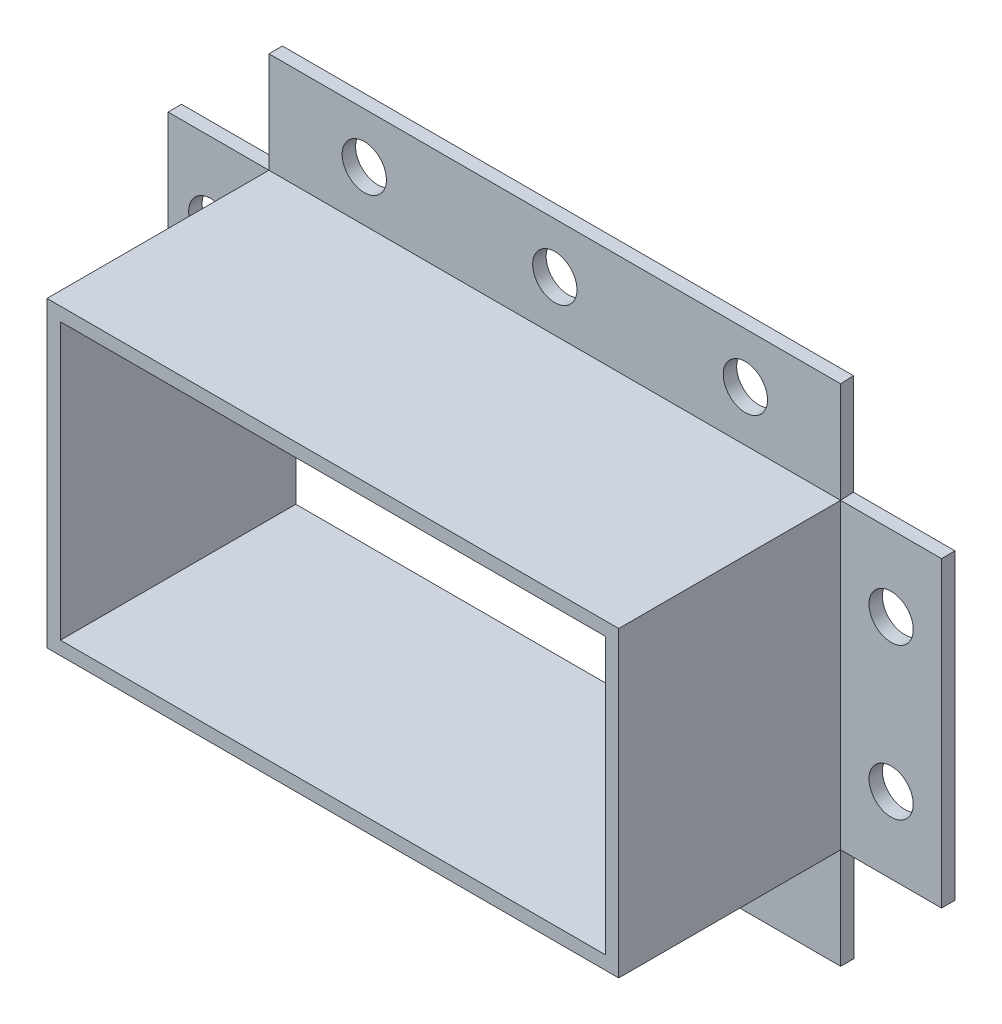
ISO-10303-21;
HEADER;
FILE_DESCRIPTION(('STEP AP214'),'2;1');
FILE_NAME('part.step','',(''),(''),'','','');
FILE_SCHEMA(('AUTOMOTIVE_DESIGN { 1 0 10303 214 1 1 1 1 }'));
ENDSEC;
DATA;
#1=APPLICATION_CONTEXT('core data for automotive mechanical design processes');
#2=APPLICATION_PROTOCOL_DEFINITION('international standard','automotive_design',2000,#1);
#3=PRODUCT_CONTEXT('',#1,'mechanical');
#4=PRODUCT('Part','Part','',(#3));
#5=PRODUCT_RELATED_PRODUCT_CATEGORY('part','',(#4));
#6=PRODUCT_DEFINITION_FORMATION('','',#4);
#7=PRODUCT_DEFINITION_CONTEXT('part definition',#1,'design');
#8=PRODUCT_DEFINITION('design','',#6,#7);
#9=PRODUCT_DEFINITION_SHAPE('','',#8);
#10=(LENGTH_UNIT() NAMED_UNIT(*) SI_UNIT(.MILLI.,.METRE.));
#11=(NAMED_UNIT(*) PLANE_ANGLE_UNIT() SI_UNIT($,.RADIAN.));
#12=(NAMED_UNIT(*) SI_UNIT($,.STERADIAN.) SOLID_ANGLE_UNIT());
#13=UNCERTAINTY_MEASURE_WITH_UNIT(LENGTH_MEASURE(1.E-05),#10,'distance_accuracy_value','');
#14=(GEOMETRIC_REPRESENTATION_CONTEXT(3) GLOBAL_UNCERTAINTY_ASSIGNED_CONTEXT((#13)) GLOBAL_UNIT_ASSIGNED_CONTEXT((#10,
#11,#12)) REPRESENTATION_CONTEXT('',''));
#15=CARTESIAN_POINT('',(0.,0.,0.));
#16=DIRECTION('',(0.,0.,1.));
#17=DIRECTION('',(1.,0.,0.));
#18=AXIS2_PLACEMENT_3D('',#15,#16,#17);
#19=CARTESIAN_POINT('',(-42.5,-22.5,35.));
#20=DIRECTION('',(0.,1.,0.));
#21=DIRECTION('',(0.,0.,1.));
#22=AXIS2_PLACEMENT_3D('',#19,#20,#21);
#23=PLANE('',#22);
#24=DIRECTION('',(0.,0.,1.));
#25=VECTOR('',#24,1.);
#26=CARTESIAN_POINT('',(42.5,-22.5,1.99999999999999));
#27=LINE('',#26,#25);
#28=CARTESIAN_POINT('',(42.5,-22.5,0.));
#29=VERTEX_POINT('',#28);
#30=CARTESIAN_POINT('',(42.5,-22.5,1.99999999999999));
#31=VERTEX_POINT('',#30);
#32=EDGE_CURVE('E64',#29,#31,#27,.T.);
#33=ORIENTED_EDGE('',*,*,#32,.F.);
#34=DIRECTION('',(1.,0.,0.));
#35=VECTOR('',#34,1.);
#36=CARTESIAN_POINT('',(-42.5,-22.5,0.));
#37=LINE('',#36,#35);
#38=CARTESIAN_POINT('',(57.5,-22.5,0.));
#39=VERTEX_POINT('',#38);
#40=EDGE_CURVE('E423',#29,#39,#37,.T.);
#41=ORIENTED_EDGE('',*,*,#40,.T.);
#42=DIRECTION('',(0.,0.,-1.));
#43=VECTOR('',#42,1.);
#44=CARTESIAN_POINT('',(57.5,-22.5,1.99999999999999));
#45=LINE('',#44,#43);
#46=CARTESIAN_POINT('',(57.5,-22.5,1.99999999999999));
#47=VERTEX_POINT('',#46);
#48=EDGE_CURVE('E369',#47,#39,#45,.T.);
#49=ORIENTED_EDGE('',*,*,#48,.F.);
#50=DIRECTION('',(-1.,0.,0.));
#51=VECTOR('',#50,1.);
#52=CARTESIAN_POINT('',(57.5,-22.5,1.99999999999999));
#53=LINE('',#52,#51);
#54=EDGE_CURVE('E373',#47,#31,#53,.T.);
#55=ORIENTED_EDGE('',*,*,#54,.T.);
#56=EDGE_LOOP('',(#33,#41,#49,#55));
#57=FACE_BOUND('',#56,.T.);
#58=ADVANCED_FACE('F38',(#57),#23,.F.);
#59=DIRECTION('',(-1.,0.,0.));
#60=VECTOR('',#59,1.);
#61=CARTESIAN_POINT('',(42.5,-22.5,1.99999999999999));
#62=LINE('',#61,#60);
#63=CARTESIAN_POINT('',(-42.5,-22.5,1.99999999999999));
#64=VERTEX_POINT('',#63);
#65=EDGE_CURVE('E266',#31,#64,#62,.T.);
#66=ORIENTED_EDGE('',*,*,#65,.F.);
#67=DIRECTION('',(0.,0.,-1.));
#68=VECTOR('',#67,1.);
#69=CARTESIAN_POINT('',(42.5,-22.5,35.));
#70=LINE('',#69,#68);
#71=CARTESIAN_POINT('',(42.5,-22.5,35.));
#72=VERTEX_POINT('',#71);
#73=EDGE_CURVE('E417',#72,#31,#70,.T.);
#74=ORIENTED_EDGE('',*,*,#73,.F.);
#75=DIRECTION('',(1.,0.,0.));
#76=VECTOR('',#75,1.);
#77=CARTESIAN_POINT('',(-42.5,-22.5,35.));
#78=LINE('',#77,#76);
#79=CARTESIAN_POINT('',(-42.5,-22.5,35.));
#80=VERTEX_POINT('',#79);
#81=EDGE_CURVE('E414',#80,#72,#78,.T.);
#82=ORIENTED_EDGE('',*,*,#81,.F.);
#83=DIRECTION('',(0.,0.,-1.));
#84=VECTOR('',#83,1.);
#85=CARTESIAN_POINT('',(-42.5,-22.5,35.));
#86=LINE('',#85,#84);
#87=EDGE_CURVE('E429',#80,#64,#86,.T.);
#88=ORIENTED_EDGE('',*,*,#87,.T.);
#89=EDGE_LOOP('',(#66,#74,#82,#88));
#90=FACE_BOUND('',#89,.T.);
#91=ADVANCED_FACE('F476',(#90),#23,.F.);
#92=DIRECTION('',(0.,0.,-1.));
#93=VECTOR('',#92,1.);
#94=CARTESIAN_POINT('',(-42.5,-22.5,1.99999999999999));
#95=LINE('',#94,#93);
#96=CARTESIAN_POINT('',(-42.5,-22.5,0.));
#97=VERTEX_POINT('',#96);
#98=EDGE_CURVE('E270',#64,#97,#95,.T.);
#99=ORIENTED_EDGE('',*,*,#98,.F.);
#100=DIRECTION('',(1.,0.,0.));
#101=VECTOR('',#100,1.);
#102=CARTESIAN_POINT('',(-57.5,-22.5,1.99999999999999));
#103=LINE('',#102,#101);
#104=CARTESIAN_POINT('',(-57.5,-22.5,1.99999999999999));
#105=VERTEX_POINT('',#104);
#106=EDGE_CURVE('E307',#105,#64,#103,.T.);
#107=ORIENTED_EDGE('',*,*,#106,.F.);
#108=DIRECTION('',(0.,0.,1.));
#109=VECTOR('',#108,1.);
#110=CARTESIAN_POINT('',(-57.5,-22.5,1.99999999999999));
#111=LINE('',#110,#109);
#112=CARTESIAN_POINT('',(-57.5,-22.5,0.));
#113=VERTEX_POINT('',#112);
#114=EDGE_CURVE('E304',#113,#105,#111,.T.);
#115=ORIENTED_EDGE('',*,*,#114,.F.);
#116=EDGE_CURVE('E408',#113,#97,#37,.T.);
#117=ORIENTED_EDGE('',*,*,#116,.T.);
#118=EDGE_LOOP('',(#99,#107,#115,#117));
#119=FACE_BOUND('',#118,.T.);
#120=ADVANCED_FACE('F478',(#119),#23,.F.);
#121=CARTESIAN_POINT('',(-42.5,22.5,35.));
#122=DIRECTION('',(1.,0.,0.));
#123=DIRECTION('',(0.,0.,-1.));
#124=AXIS2_PLACEMENT_3D('',#121,#122,#123);
#125=PLANE('',#124);
#126=DIRECTION('',(0.,1.,0.));
#127=VECTOR('',#126,1.);
#128=CARTESIAN_POINT('',(-42.5,22.5,1.99999999999999));
#129=LINE('',#128,#127);
#130=CARTESIAN_POINT('',(-42.5,22.5,1.99999999999999));
#131=VERTEX_POINT('',#130);
#132=EDGE_CURVE('E291',#64,#131,#129,.T.);
#133=ORIENTED_EDGE('',*,*,#132,.F.);
#134=ORIENTED_EDGE('',*,*,#87,.F.);
#135=DIRECTION('',(0.,-1.,0.));
#136=VECTOR('',#135,1.);
#137=CARTESIAN_POINT('',(-42.5,22.5,35.));
#138=LINE('',#137,#136);
#139=CARTESIAN_POINT('',(-42.5,22.5,35.));
#140=VERTEX_POINT('',#139);
#141=EDGE_CURVE('E411',#140,#80,#138,.T.);
#142=ORIENTED_EDGE('',*,*,#141,.F.);
#143=DIRECTION('',(0.,0.,-1.));
#144=VECTOR('',#143,1.);
#145=CARTESIAN_POINT('',(-42.5,22.5,35.));
#146=LINE('',#145,#144);
#147=EDGE_CURVE('E48',#140,#131,#146,.T.);
#148=ORIENTED_EDGE('',*,*,#147,.T.);
#149=EDGE_LOOP('',(#133,#134,#142,#148));
#150=FACE_BOUND('',#149,.T.);
#151=ADVANCED_FACE('F486',(#150),#125,.F.);
#152=DIRECTION('',(0.,0.,-1.));
#153=VECTOR('',#152,1.);
#154=CARTESIAN_POINT('',(-42.5,22.5,1.99999999999999));
#155=LINE('',#154,#153);
#156=CARTESIAN_POINT('',(-42.5,22.5,0.));
#157=VERTEX_POINT('',#156);
#158=EDGE_CURVE('E297',#131,#157,#155,.T.);
#159=ORIENTED_EDGE('',*,*,#158,.F.);
#160=DIRECTION('',(0.,-1.,0.));
#161=VECTOR('',#160,1.);
#162=CARTESIAN_POINT('',(-42.5,37.5,1.99999999999999));
#163=LINE('',#162,#161);
#164=CARTESIAN_POINT('',(-42.5,37.5,1.99999999999999));
#165=VERTEX_POINT('',#164);
#166=EDGE_CURVE('E354',#165,#131,#163,.T.);
#167=ORIENTED_EDGE('',*,*,#166,.F.);
#168=DIRECTION('',(0.,0.,1.));
#169=VECTOR('',#168,1.);
#170=CARTESIAN_POINT('',(-42.5,37.5,1.99999999999999));
#171=LINE('',#170,#169);
#172=CARTESIAN_POINT('',(-42.5,37.5,0.));
#173=VERTEX_POINT('',#172);
#174=EDGE_CURVE('E330',#173,#165,#171,.T.);
#175=ORIENTED_EDGE('',*,*,#174,.F.);
#176=DIRECTION('',(0.,-1.,0.));
#177=VECTOR('',#176,1.);
#178=CARTESIAN_POINT('',(-42.5,22.5,0.));
#179=LINE('',#178,#177);
#180=EDGE_CURVE('E420',#173,#157,#179,.T.);
#181=ORIENTED_EDGE('',*,*,#180,.T.);
#182=EDGE_LOOP('',(#159,#167,#175,#181));
#183=FACE_BOUND('',#182,.T.);
#184=ADVANCED_FACE('F491',(#183),#125,.F.);
#185=CARTESIAN_POINT('',(-42.5,22.5,35.));
#186=DIRECTION('',(0.,-1.,0.));
#187=DIRECTION('',(1.,0.,0.));
#188=AXIS2_PLACEMENT_3D('',#185,#186,#187);
#189=PLANE('',#188);
#190=DIRECTION('',(-0.0510792903372847,0.,-0.998694601016066));
#191=VECTOR('',#190,1.);
#192=CARTESIAN_POINT('',(42.3977078873055,22.5,0.));
#193=LINE('',#192,#191);
#194=CARTESIAN_POINT('',(42.5,22.5,1.99999999999999));
#195=VERTEX_POINT('',#194);
#196=CARTESIAN_POINT('',(42.3977078873055,22.5,0.));
#197=VERTEX_POINT('',#196);
#198=EDGE_CURVE('E331',#195,#197,#193,.T.);
#199=ORIENTED_EDGE('',*,*,#198,.F.);
#200=DIRECTION('',(-1.,0.,0.));
#201=VECTOR('',#200,1.);
#202=CARTESIAN_POINT('',(57.5,22.5,2.));
#203=LINE('',#202,#201);
#204=CARTESIAN_POINT('',(57.5,22.5,2.));
#205=VERTEX_POINT('',#204);
#206=EDGE_CURVE('E379',#205,#195,#203,.T.);
#207=ORIENTED_EDGE('',*,*,#206,.F.);
#208=DIRECTION('',(0.,0.,1.));
#209=VECTOR('',#208,1.);
#210=CARTESIAN_POINT('',(57.5,22.5,0.));
#211=LINE('',#210,#209);
#212=CARTESIAN_POINT('',(57.5,22.5,0.));
#213=VERTEX_POINT('',#212);
#214=EDGE_CURVE('E363',#213,#205,#211,.T.);
#215=ORIENTED_EDGE('',*,*,#214,.F.);
#216=DIRECTION('',(-1.,0.,0.));
#217=VECTOR('',#216,1.);
#218=CARTESIAN_POINT('',(-42.5,22.5,0.));
#219=LINE('',#218,#217);
#220=EDGE_CURVE('E396',#213,#197,#219,.T.);
#221=ORIENTED_EDGE('',*,*,#220,.T.);
#222=EDGE_LOOP('',(#199,#207,#215,#221));
#223=FACE_BOUND('',#222,.T.);
#224=ADVANCED_FACE('F536',(#223),#189,.F.);
#225=DIRECTION('',(1.,0.,0.));
#226=VECTOR('',#225,1.);
#227=CARTESIAN_POINT('',(42.5,22.5,1.99999999999999));
#228=LINE('',#227,#226);
#229=EDGE_CURVE('E325',#131,#195,#228,.T.);
#230=ORIENTED_EDGE('',*,*,#229,.F.);
#231=ORIENTED_EDGE('',*,*,#147,.F.);
#232=DIRECTION('',(-1.,0.,0.));
#233=VECTOR('',#232,1.);
#234=CARTESIAN_POINT('',(-42.5,22.5,35.));
#235=LINE('',#234,#233);
#236=CARTESIAN_POINT('',(42.5,22.5,35.));
#237=VERTEX_POINT('',#236);
#238=EDGE_CURVE('E407',#237,#140,#235,.T.);
#239=ORIENTED_EDGE('',*,*,#238,.F.);
#240=DIRECTION('',(0.,0.,-1.));
#241=VECTOR('',#240,1.);
#242=CARTESIAN_POINT('',(42.5,22.5,35.));
#243=LINE('',#242,#241);
#244=EDGE_CURVE('E11',#237,#195,#243,.T.);
#245=ORIENTED_EDGE('',*,*,#244,.T.);
#246=EDGE_LOOP('',(#230,#231,#239,#245));
#247=FACE_BOUND('',#246,.T.);
#248=ADVANCED_FACE('F648',(#247),#189,.F.);
#249=CARTESIAN_POINT('',(42.5,22.5,35.));
#250=DIRECTION('',(-1.,0.,0.));
#251=DIRECTION('',(0.,0.,1.));
#252=AXIS2_PLACEMENT_3D('',#249,#250,#251);
#253=PLANE('',#252);
#254=DIRECTION('',(0.,-1.,0.));
#255=VECTOR('',#254,1.);
#256=CARTESIAN_POINT('',(42.5,22.5,2.));
#257=LINE('',#256,#255);
#258=EDGE_CURVE('E358',#195,#31,#257,.T.);
#259=ORIENTED_EDGE('',*,*,#258,.F.);
#260=ORIENTED_EDGE('',*,*,#244,.F.);
#261=DIRECTION('',(0.,1.,0.));
#262=VECTOR('',#261,1.);
#263=CARTESIAN_POINT('',(42.5,22.5,35.));
#264=LINE('',#263,#262);
#265=EDGE_CURVE('E403',#72,#237,#264,.T.);
#266=ORIENTED_EDGE('',*,*,#265,.F.);
#267=ORIENTED_EDGE('',*,*,#73,.T.);
#268=EDGE_LOOP('',(#259,#260,#266,#267));
#269=FACE_BOUND('',#268,.T.);
#270=ADVANCED_FACE('F40',(#269),#253,.F.);
#271=CARTESIAN_POINT('',(0.,0.,35.));
#272=DIRECTION('',(0.,0.,1.));
#273=DIRECTION('',(1.,0.,0.));
#274=AXIS2_PLACEMENT_3D('',#271,#272,#273);
#275=PLANE('',#274);
#276=DIRECTION('',(0.,-1.,0.));
#277=VECTOR('',#276,1.);
#278=CARTESIAN_POINT('',(-40.5,20.5,35.));
#279=LINE('',#278,#277);
#280=CARTESIAN_POINT('',(-40.5,20.5,35.));
#281=VERTEX_POINT('',#280);
#282=CARTESIAN_POINT('',(-40.5,-20.5,35.));
#283=VERTEX_POINT('',#282);
#284=EDGE_CURVE('E185',#281,#283,#279,.T.);
#285=ORIENTED_EDGE('',*,*,#284,.F.);
#286=DIRECTION('',(-1.,0.,0.));
#287=VECTOR('',#286,1.);
#288=CARTESIAN_POINT('',(40.5,20.5,35.));
#289=LINE('',#288,#287);
#290=CARTESIAN_POINT('',(40.5,20.5,35.));
#291=VERTEX_POINT('',#290);
#292=EDGE_CURVE('E190',#291,#281,#289,.T.);
#293=ORIENTED_EDGE('',*,*,#292,.F.);
#294=DIRECTION('',(0.,1.,0.));
#295=VECTOR('',#294,1.);
#296=CARTESIAN_POINT('',(40.5,20.5,35.));
#297=LINE('',#296,#295);
#298=CARTESIAN_POINT('',(40.5,-20.5,35.));
#299=VERTEX_POINT('',#298);
#300=EDGE_CURVE('E171',#299,#291,#297,.T.);
#301=ORIENTED_EDGE('',*,*,#300,.F.);
#302=DIRECTION('',(1.,0.,0.));
#303=VECTOR('',#302,1.);
#304=CARTESIAN_POINT('',(40.5,-20.5,35.));
#305=LINE('',#304,#303);
#306=EDGE_CURVE('E180',#283,#299,#305,.T.);
#307=ORIENTED_EDGE('',*,*,#306,.F.);
#308=EDGE_LOOP('',(#285,#293,#301,#307));
#309=FACE_BOUND('',#308,.T.);
#310=ORIENTED_EDGE('',*,*,#265,.T.);
#311=ORIENTED_EDGE('',*,*,#238,.T.);
#312=ORIENTED_EDGE('',*,*,#141,.T.);
#313=ORIENTED_EDGE('',*,*,#81,.T.);
#314=EDGE_LOOP('',(#310,#311,#312,#313));
#315=FACE_BOUND('',#314,.T.);
#316=ADVANCED_FACE('F187',(#309,#315),#275,.T.);
#317=CARTESIAN_POINT('',(0.,0.,0.));
#318=DIRECTION('',(0.,0.,1.));
#319=DIRECTION('',(1.,0.,0.));
#320=AXIS2_PLACEMENT_3D('',#317,#318,#319);
#321=PLANE('',#320);
#322=CARTESIAN_POINT('',(50.,11.25,0.));
#323=DIRECTION('',(0.,0.,1.));
#324=DIRECTION('',(1.,0.,0.));
#325=AXIS2_PLACEMENT_3D('',#322,#323,#324);
#326=CIRCLE('',#325,3.28999849999999);
#327=CARTESIAN_POINT('',(53.2899985,11.25,0.));
#328=VERTEX_POINT('',#327);
#329=EDGE_CURVE('E42',#328,#328,#326,.T.);
#330=ORIENTED_EDGE('',*,*,#329,.T.);
#331=EDGE_LOOP('',(#330));
#332=FACE_BOUND('',#331,.T.);
#333=CARTESIAN_POINT('',(50.,-11.25,0.));
#334=DIRECTION('',(0.,0.,1.));
#335=DIRECTION('',(1.,0.,0.));
#336=AXIS2_PLACEMENT_3D('',#333,#334,#335);
#337=CIRCLE('',#336,3.28999849999999);
#338=CARTESIAN_POINT('',(53.2899985,-11.25,0.));
#339=VERTEX_POINT('',#338);
#340=EDGE_CURVE('E205',#339,#339,#337,.T.);
#341=ORIENTED_EDGE('',*,*,#340,.T.);
#342=EDGE_LOOP('',(#341));
#343=FACE_BOUND('',#342,.T.);
#344=CARTESIAN_POINT('',(-51.1524006128283,-11.25,0.));
#345=DIRECTION('',(0.,0.,1.));
#346=DIRECTION('',(1.,0.,0.));
#347=AXIS2_PLACEMENT_3D('',#344,#345,#346);
#348=CIRCLE('',#347,3.28999849999999);
#349=CARTESIAN_POINT('',(-47.8624021128283,-11.25,0.));
#350=VERTEX_POINT('',#349);
#351=EDGE_CURVE('E210',#350,#350,#348,.T.);
#352=ORIENTED_EDGE('',*,*,#351,.T.);
#353=EDGE_LOOP('',(#352));
#354=FACE_BOUND('',#353,.T.);
#355=CARTESIAN_POINT('',(-51.1524006128283,11.25,0.));
#356=DIRECTION('',(0.,0.,1.));
#357=DIRECTION('',(1.,0.,0.));
#358=AXIS2_PLACEMENT_3D('',#355,#356,#357);
#359=CIRCLE('',#358,3.28999849999999);
#360=CARTESIAN_POINT('',(-47.8624021128283,11.25,0.));
#361=VERTEX_POINT('',#360);
#362=EDGE_CURVE('E215',#361,#361,#359,.T.);
#363=ORIENTED_EDGE('',*,*,#362,.T.);
#364=EDGE_LOOP('',(#363));
#365=FACE_BOUND('',#364,.T.);
#366=CARTESIAN_POINT('',(-28.33,30.,0.));
#367=DIRECTION('',(0.,0.,1.));
#368=DIRECTION('',(1.,0.,0.));
#369=AXIS2_PLACEMENT_3D('',#366,#367,#368);
#370=CIRCLE('',#369,3.28999849999999);
#371=CARTESIAN_POINT('',(-25.0400015,30.,0.));
#372=VERTEX_POINT('',#371);
#373=EDGE_CURVE('E220',#372,#372,#370,.T.);
#374=ORIENTED_EDGE('',*,*,#373,.T.);
#375=EDGE_LOOP('',(#374));
#376=FACE_BOUND('',#375,.T.);
#377=CARTESIAN_POINT('',(0.,30.,0.));
#378=DIRECTION('',(0.,0.,1.));
#379=DIRECTION('',(1.,0.,0.));
#380=AXIS2_PLACEMENT_3D('',#377,#378,#379);
#381=CIRCLE('',#380,3.28999849999999);
#382=CARTESIAN_POINT('',(3.28999849999999,30.,0.));
#383=VERTEX_POINT('',#382);
#384=EDGE_CURVE('E228',#383,#383,#381,.T.);
#385=ORIENTED_EDGE('',*,*,#384,.T.);
#386=EDGE_LOOP('',(#385));
#387=FACE_BOUND('',#386,.T.);
#388=CARTESIAN_POINT('',(28.33,30.,0.));
#389=DIRECTION('',(0.,0.,1.));
#390=DIRECTION('',(1.,0.,0.));
#391=AXIS2_PLACEMENT_3D('',#388,#389,#390);
#392=CIRCLE('',#391,3.28999849999999);
#393=CARTESIAN_POINT('',(31.6199985,30.,0.));
#394=VERTEX_POINT('',#393);
#395=EDGE_CURVE('E233',#394,#394,#392,.T.);
#396=ORIENTED_EDGE('',*,*,#395,.T.);
#397=EDGE_LOOP('',(#396));
#398=FACE_BOUND('',#397,.T.);
#399=CARTESIAN_POINT('',(28.33,-30.,0.));
#400=DIRECTION('',(0.,0.,1.));
#401=DIRECTION('',(1.,0.,0.));
#402=AXIS2_PLACEMENT_3D('',#399,#400,#401);
#403=CIRCLE('',#402,3.28999849999999);
#404=CARTESIAN_POINT('',(31.6199985,-30.,0.));
#405=VERTEX_POINT('',#404);
#406=EDGE_CURVE('E238',#405,#405,#403,.T.);
#407=ORIENTED_EDGE('',*,*,#406,.T.);
#408=EDGE_LOOP('',(#407));
#409=FACE_BOUND('',#408,.T.);
#410=CARTESIAN_POINT('',(0.,-30.,0.));
#411=DIRECTION('',(0.,0.,1.));
#412=DIRECTION('',(1.,0.,0.));
#413=AXIS2_PLACEMENT_3D('',#410,#411,#412);
#414=CIRCLE('',#413,3.28999849999999);
#415=CARTESIAN_POINT('',(3.28999849999999,-30.,0.));
#416=VERTEX_POINT('',#415);
#417=EDGE_CURVE('E243',#416,#416,#414,.T.);
#418=ORIENTED_EDGE('',*,*,#417,.T.);
#419=EDGE_LOOP('',(#418));
#420=FACE_BOUND('',#419,.T.);
#421=CARTESIAN_POINT('',(-28.33,-30.,0.));
#422=DIRECTION('',(0.,0.,1.));
#423=DIRECTION('',(1.,0.,0.));
#424=AXIS2_PLACEMENT_3D('',#421,#422,#423);
#425=CIRCLE('',#424,3.28999849999999);
#426=CARTESIAN_POINT('',(-25.0400015,-30.,0.));
#427=VERTEX_POINT('',#426);
#428=EDGE_CURVE('E251',#427,#427,#425,.T.);
#429=ORIENTED_EDGE('',*,*,#428,.T.);
#430=EDGE_LOOP('',(#429));
#431=FACE_BOUND('',#430,.T.);
#432=DIRECTION('',(1.,0.,0.));
#433=VECTOR('',#432,1.);
#434=CARTESIAN_POINT('',(40.5,20.5,0.));
#435=LINE('',#434,#433);
#436=CARTESIAN_POINT('',(-40.5,20.5,0.));
#437=VERTEX_POINT('',#436);
#438=CARTESIAN_POINT('',(40.5,20.5,0.));
#439=VERTEX_POINT('',#438);
#440=EDGE_CURVE('E385',#437,#439,#435,.T.);
#441=ORIENTED_EDGE('',*,*,#440,.F.);
#442=DIRECTION('',(0.,1.,0.));
#443=VECTOR('',#442,1.);
#444=CARTESIAN_POINT('',(-40.5,20.5,0.));
#445=LINE('',#444,#443);
#446=CARTESIAN_POINT('',(-40.5,-20.5,0.));
#447=VERTEX_POINT('',#446);
#448=EDGE_CURVE('E382',#447,#437,#445,.T.);
#449=ORIENTED_EDGE('',*,*,#448,.F.);
#450=DIRECTION('',(-1.,0.,0.));
#451=VECTOR('',#450,1.);
#452=CARTESIAN_POINT('',(40.5,-20.5,0.));
#453=LINE('',#452,#451);
#454=CARTESIAN_POINT('',(40.5,-20.5,0.));
#455=VERTEX_POINT('',#454);
#456=EDGE_CURVE('E391',#455,#447,#453,.T.);
#457=ORIENTED_EDGE('',*,*,#456,.F.);
#458=DIRECTION('',(0.,-1.,0.));
#459=VECTOR('',#458,1.);
#460=CARTESIAN_POINT('',(40.5,20.5,0.));
#461=LINE('',#460,#459);
#462=EDGE_CURVE('E174',#439,#455,#461,.T.);
#463=ORIENTED_EDGE('',*,*,#462,.F.);
#464=EDGE_LOOP('',(#441,#449,#457,#463));
#465=FACE_BOUND('',#464,.T.);
#466=ORIENTED_EDGE('',*,*,#220,.F.);
#467=DIRECTION('',(0.,1.,0.));
#468=VECTOR('',#467,1.);
#469=CARTESIAN_POINT('',(57.5,-22.5,0.));
#470=LINE('',#469,#468);
#471=EDGE_CURVE('E359',#39,#213,#470,.T.);
#472=ORIENTED_EDGE('',*,*,#471,.F.);
#473=ORIENTED_EDGE('',*,*,#40,.F.);
#474=DIRECTION('',(0.,1.,0.));
#475=VECTOR('',#474,1.);
#476=CARTESIAN_POINT('',(42.5,-37.5,0.));
#477=LINE('',#476,#475);
#478=CARTESIAN_POINT('',(42.5,-37.5,0.));
#479=VERTEX_POINT('',#478);
#480=EDGE_CURVE('E279',#479,#29,#477,.T.);
#481=ORIENTED_EDGE('',*,*,#480,.F.);
#482=DIRECTION('',(1.,0.,0.));
#483=VECTOR('',#482,1.);
#484=CARTESIAN_POINT('',(-42.5,-37.5,0.));
#485=LINE('',#484,#483);
#486=CARTESIAN_POINT('',(-42.5,-37.5,0.));
#487=VERTEX_POINT('',#486);
#488=EDGE_CURVE('E259',#487,#479,#485,.T.);
#489=ORIENTED_EDGE('',*,*,#488,.F.);
#490=DIRECTION('',(0.,1.,0.));
#491=VECTOR('',#490,1.);
#492=CARTESIAN_POINT('',(-42.5,-37.5,0.));
#493=LINE('',#492,#491);
#494=EDGE_CURVE('E283',#487,#97,#493,.T.);
#495=ORIENTED_EDGE('',*,*,#494,.T.);
#496=ORIENTED_EDGE('',*,*,#116,.F.);
#497=DIRECTION('',(0.,-1.,0.));
#498=VECTOR('',#497,1.);
#499=CARTESIAN_POINT('',(-57.5,22.5,0.));
#500=LINE('',#499,#498);
#501=CARTESIAN_POINT('',(-57.5,22.5,0.));
#502=VERTEX_POINT('',#501);
#503=EDGE_CURVE('E300',#502,#113,#500,.T.);
#504=ORIENTED_EDGE('',*,*,#503,.F.);
#505=DIRECTION('',(1.,0.,0.));
#506=VECTOR('',#505,1.);
#507=CARTESIAN_POINT('',(-57.5,22.5,0.));
#508=LINE('',#507,#506);
#509=EDGE_CURVE('E317',#502,#157,#508,.T.);
#510=ORIENTED_EDGE('',*,*,#509,.T.);
#511=ORIENTED_EDGE('',*,*,#180,.F.);
#512=DIRECTION('',(-1.,0.,0.));
#513=VECTOR('',#512,1.);
#514=CARTESIAN_POINT('',(42.3977078873055,37.5,0.));
#515=LINE('',#514,#513);
#516=CARTESIAN_POINT('',(42.3977078873055,37.5,0.));
#517=VERTEX_POINT('',#516);
#518=EDGE_CURVE('E326',#517,#173,#515,.T.);
#519=ORIENTED_EDGE('',*,*,#518,.F.);
#520=DIRECTION('',(0.,-1.,0.));
#521=VECTOR('',#520,1.);
#522=CARTESIAN_POINT('',(42.3977078873055,37.5,0.));
#523=LINE('',#522,#521);
#524=EDGE_CURVE('E340',#517,#197,#523,.T.);
#525=ORIENTED_EDGE('',*,*,#524,.T.);
#526=EDGE_LOOP('',(#466,#472,#473,#481,#489,#495,#496,#504,#510,#511,#519,#525));
#527=FACE_BOUND('',#526,.T.);
#528=ADVANCED_FACE('F457',(#332,#343,#354,#365,#376,#387,#398,#409,#420,#431,#465,#527),#321,.F.);
#529=CARTESIAN_POINT('',(-40.5,20.5,33.));
#530=DIRECTION('',(-1.,0.,0.));
#531=DIRECTION('',(0.,0.,1.));
#532=AXIS2_PLACEMENT_3D('',#529,#530,#531);
#533=PLANE('',#532);
#534=ORIENTED_EDGE('',*,*,#448,.T.);
#535=DIRECTION('',(0.,0.,-1.));
#536=VECTOR('',#535,1.);
#537=CARTESIAN_POINT('',(-40.5,20.5,33.));
#538=LINE('',#537,#536);
#539=EDGE_CURVE('E394',#281,#437,#538,.T.);
#540=ORIENTED_EDGE('',*,*,#539,.F.);
#541=ORIENTED_EDGE('',*,*,#284,.T.);
#542=DIRECTION('',(0.,0.,-1.));
#543=VECTOR('',#542,1.);
#544=CARTESIAN_POINT('',(-40.5,-20.5,33.));
#545=LINE('',#544,#543);
#546=EDGE_CURVE('E56',#283,#447,#545,.T.);
#547=ORIENTED_EDGE('',*,*,#546,.T.);
#548=EDGE_LOOP('',(#534,#540,#541,#547));
#549=FACE_BOUND('',#548,.T.);
#550=ADVANCED_FACE('F588',(#549),#533,.F.);
#551=CARTESIAN_POINT('',(40.5,-20.5,33.));
#552=DIRECTION('',(0.,-1.,0.));
#553=DIRECTION('',(0.,0.,-1.));
#554=AXIS2_PLACEMENT_3D('',#551,#552,#553);
#555=PLANE('',#554);
#556=ORIENTED_EDGE('',*,*,#456,.T.);
#557=ORIENTED_EDGE('',*,*,#546,.F.);
#558=ORIENTED_EDGE('',*,*,#306,.T.);
#559=DIRECTION('',(0.,0.,-1.));
#560=VECTOR('',#559,1.);
#561=CARTESIAN_POINT('',(40.5,-20.5,33.));
#562=LINE('',#561,#560);
#563=EDGE_CURVE('E168',#299,#455,#562,.T.);
#564=ORIENTED_EDGE('',*,*,#563,.T.);
#565=EDGE_LOOP('',(#556,#557,#558,#564));
#566=FACE_BOUND('',#565,.T.);
#567=ADVANCED_FACE('F181',(#566),#555,.F.);
#568=CARTESIAN_POINT('',(40.5,20.5,33.));
#569=DIRECTION('',(1.,0.,0.));
#570=DIRECTION('',(0.,0.,-1.));
#571=AXIS2_PLACEMENT_3D('',#568,#569,#570);
#572=PLANE('',#571);
#573=ORIENTED_EDGE('',*,*,#462,.T.);
#574=ORIENTED_EDGE('',*,*,#563,.F.);
#575=ORIENTED_EDGE('',*,*,#300,.T.);
#576=DIRECTION('',(0.,0.,-1.));
#577=VECTOR('',#576,1.);
#578=CARTESIAN_POINT('',(40.5,20.5,33.));
#579=LINE('',#578,#577);
#580=EDGE_CURVE('E177',#291,#439,#579,.T.);
#581=ORIENTED_EDGE('',*,*,#580,.T.);
#582=EDGE_LOOP('',(#573,#574,#575,#581));
#583=FACE_BOUND('',#582,.T.);
#584=ADVANCED_FACE('F169',(#583),#572,.F.);
#585=CARTESIAN_POINT('',(40.5,20.5,33.));
#586=DIRECTION('',(0.,1.,0.));
#587=DIRECTION('',(0.,0.,1.));
#588=AXIS2_PLACEMENT_3D('',#585,#586,#587);
#589=PLANE('',#588);
#590=ORIENTED_EDGE('',*,*,#440,.T.);
#591=ORIENTED_EDGE('',*,*,#580,.F.);
#592=ORIENTED_EDGE('',*,*,#292,.T.);
#593=ORIENTED_EDGE('',*,*,#539,.T.);
#594=EDGE_LOOP('',(#590,#591,#592,#593));
#595=FACE_BOUND('',#594,.T.);
#596=ADVANCED_FACE('F584',(#595),#589,.F.);
#597=CARTESIAN_POINT('',(57.5,22.5,2.));
#598=DIRECTION('',(0.,0.,-1.));
#599=DIRECTION('',(0.,1.,0.));
#600=AXIS2_PLACEMENT_3D('',#597,#598,#599);
#601=PLANE('',#600);
#602=CARTESIAN_POINT('',(50.,11.25,2.));
#603=DIRECTION('',(0.,0.,1.));
#604=DIRECTION('',(1.,0.,0.));
#605=AXIS2_PLACEMENT_3D('',#602,#603,#604);
#606=CIRCLE('',#605,3.28999849999999);
#607=CARTESIAN_POINT('',(53.2899985,11.25,2.));
#608=VERTEX_POINT('',#607);
#609=EDGE_CURVE('E194',#608,#608,#606,.T.);
#610=ORIENTED_EDGE('',*,*,#609,.F.);
#611=EDGE_LOOP('',(#610));
#612=FACE_BOUND('',#611,.T.);
#613=CARTESIAN_POINT('',(50.,-11.25,2.));
#614=DIRECTION('',(0.,0.,1.));
#615=DIRECTION('',(1.,0.,0.));
#616=AXIS2_PLACEMENT_3D('',#613,#614,#615);
#617=CIRCLE('',#616,3.28999849999999);
#618=CARTESIAN_POINT('',(53.2899985,-11.25,2.));
#619=VERTEX_POINT('',#618);
#620=EDGE_CURVE('E201',#619,#619,#617,.T.);
#621=ORIENTED_EDGE('',*,*,#620,.F.);
#622=EDGE_LOOP('',(#621));
#623=FACE_BOUND('',#622,.T.);
#624=ORIENTED_EDGE('',*,*,#258,.T.);
#625=ORIENTED_EDGE('',*,*,#54,.F.);
#626=DIRECTION('',(0.,-1.,0.));
#627=VECTOR('',#626,1.);
#628=CARTESIAN_POINT('',(57.5,22.5,2.));
#629=LINE('',#628,#627);
#630=EDGE_CURVE('E366',#205,#47,#629,.T.);
#631=ORIENTED_EDGE('',*,*,#630,.F.);
#632=ORIENTED_EDGE('',*,*,#206,.T.);
#633=EDGE_LOOP('',(#624,#625,#631,#632));
#634=FACE_BOUND('',#633,.T.);
#635=ADVANCED_FACE('F529',(#612,#623,#634),#601,.F.);
#636=CARTESIAN_POINT('',(57.5,0.,0.));
#637=DIRECTION('',(1.,0.,0.));
#638=DIRECTION('',(0.,0.,-1.));
#639=AXIS2_PLACEMENT_3D('',#636,#637,#638);
#640=PLANE('',#639);
#641=ORIENTED_EDGE('',*,*,#471,.T.);
#642=ORIENTED_EDGE('',*,*,#214,.T.);
#643=ORIENTED_EDGE('',*,*,#630,.T.);
#644=ORIENTED_EDGE('',*,*,#48,.T.);
#645=EDGE_LOOP('',(#641,#642,#643,#644));
#646=FACE_BOUND('',#645,.T.);
#647=ADVANCED_FACE('F523',(#646),#640,.T.);
#648=CARTESIAN_POINT('',(42.5,37.5,1.99999999999999));
#649=DIRECTION('',(0.,0.,-1.));
#650=DIRECTION('',(-1.,0.,0.));
#651=AXIS2_PLACEMENT_3D('',#648,#649,#650);
#652=PLANE('',#651);
#653=CARTESIAN_POINT('',(-28.33,30.,2.));
#654=DIRECTION('',(0.,0.,1.));
#655=DIRECTION('',(1.,0.,0.));
#656=AXIS2_PLACEMENT_3D('',#653,#654,#655);
#657=CIRCLE('',#656,3.28999849999999);
#658=CARTESIAN_POINT('',(-25.0400015,30.,2.));
#659=VERTEX_POINT('',#658);
#660=EDGE_CURVE('E216',#659,#659,#657,.T.);
#661=ORIENTED_EDGE('',*,*,#660,.F.);
#662=EDGE_LOOP('',(#661));
#663=FACE_BOUND('',#662,.T.);
#664=CARTESIAN_POINT('',(0.,30.,2.));
#665=DIRECTION('',(0.,0.,1.));
#666=DIRECTION('',(1.,0.,0.));
#667=AXIS2_PLACEMENT_3D('',#664,#665,#666);
#668=CIRCLE('',#667,3.28999849999999);
#669=CARTESIAN_POINT('',(3.28999849999999,30.,2.));
#670=VERTEX_POINT('',#669);
#671=EDGE_CURVE('E224',#670,#670,#668,.T.);
#672=ORIENTED_EDGE('',*,*,#671,.F.);
#673=EDGE_LOOP('',(#672));
#674=FACE_BOUND('',#673,.T.);
#675=CARTESIAN_POINT('',(28.33,30.,2.));
#676=DIRECTION('',(0.,0.,1.));
#677=DIRECTION('',(1.,0.,0.));
#678=AXIS2_PLACEMENT_3D('',#675,#676,#677);
#679=CIRCLE('',#678,3.28999849999999);
#680=CARTESIAN_POINT('',(31.6199985,30.,2.));
#681=VERTEX_POINT('',#680);
#682=EDGE_CURVE('E229',#681,#681,#679,.T.);
#683=ORIENTED_EDGE('',*,*,#682,.F.);
#684=EDGE_LOOP('',(#683));
#685=FACE_BOUND('',#684,.T.);
#686=ORIENTED_EDGE('',*,*,#229,.T.);
#687=DIRECTION('',(0.,-1.,0.));
#688=VECTOR('',#687,1.);
#689=CARTESIAN_POINT('',(42.5,37.5,1.99999999999999));
#690=LINE('',#689,#688);
#691=CARTESIAN_POINT('',(42.5,37.5,1.99999999999999));
#692=VERTEX_POINT('',#691);
#693=EDGE_CURVE('E350',#692,#195,#690,.T.);
#694=ORIENTED_EDGE('',*,*,#693,.F.);
#695=DIRECTION('',(1.,0.,0.));
#696=VECTOR('',#695,1.);
#697=CARTESIAN_POINT('',(42.5,37.5,1.99999999999999));
#698=LINE('',#697,#696);
#699=EDGE_CURVE('E334',#165,#692,#698,.T.);
#700=ORIENTED_EDGE('',*,*,#699,.F.);
#701=ORIENTED_EDGE('',*,*,#166,.T.);
#702=EDGE_LOOP('',(#686,#694,#700,#701));
#703=FACE_BOUND('',#702,.T.);
#704=ADVANCED_FACE('F542',(#663,#674,#685,#703),#652,.F.);
#705=CARTESIAN_POINT('',(42.3977078873055,37.5,0.));
#706=DIRECTION('',(-0.998694601016066,0.,0.0510792903372847));
#707=DIRECTION('',(0.0510792903372847,0.,0.998694601016066));
#708=AXIS2_PLACEMENT_3D('',#705,#706,#707);
#709=PLANE('',#708);
#710=ORIENTED_EDGE('',*,*,#198,.T.);
#711=ORIENTED_EDGE('',*,*,#524,.F.);
#712=DIRECTION('',(-0.0510792903372847,0.,-0.998694601016066));
#713=VECTOR('',#712,1.);
#714=CARTESIAN_POINT('',(42.3977078873055,37.5,0.));
#715=LINE('',#714,#713);
#716=EDGE_CURVE('E337',#692,#517,#715,.T.);
#717=ORIENTED_EDGE('',*,*,#716,.F.);
#718=ORIENTED_EDGE('',*,*,#693,.T.);
#719=EDGE_LOOP('',(#710,#711,#717,#718));
#720=FACE_BOUND('',#719,.T.);
#721=ADVANCED_FACE('F547',(#720),#709,.F.);
#722=CARTESIAN_POINT('',(0.,37.5,0.));
#723=DIRECTION('',(0.,-1.,0.));
#724=DIRECTION('',(0.,0.,-1.));
#725=AXIS2_PLACEMENT_3D('',#722,#723,#724);
#726=PLANE('',#725);
#727=ORIENTED_EDGE('',*,*,#518,.T.);
#728=ORIENTED_EDGE('',*,*,#174,.T.);
#729=ORIENTED_EDGE('',*,*,#699,.T.);
#730=ORIENTED_EDGE('',*,*,#716,.T.);
#731=EDGE_LOOP('',(#727,#728,#729,#730));
#732=FACE_BOUND('',#731,.T.);
#733=ADVANCED_FACE('F550',(#732),#726,.F.);
#734=CARTESIAN_POINT('',(-57.5,22.5,1.99999999999999));
#735=DIRECTION('',(0.,0.,-1.));
#736=DIRECTION('',(-1.,0.,0.));
#737=AXIS2_PLACEMENT_3D('',#734,#735,#736);
#738=PLANE('',#737);
#739=CARTESIAN_POINT('',(-51.1524006128283,-11.25,2.));
#740=DIRECTION('',(0.,0.,1.));
#741=DIRECTION('',(1.,0.,0.));
#742=AXIS2_PLACEMENT_3D('',#739,#740,#741);
#743=CIRCLE('',#742,3.28999849999999);
#744=CARTESIAN_POINT('',(-47.8624021128283,-11.25,2.));
#745=VERTEX_POINT('',#744);
#746=EDGE_CURVE('E206',#745,#745,#743,.T.);
#747=ORIENTED_EDGE('',*,*,#746,.F.);
#748=EDGE_LOOP('',(#747));
#749=FACE_BOUND('',#748,.T.);
#750=CARTESIAN_POINT('',(-51.1524006128283,11.25,2.));
#751=DIRECTION('',(0.,0.,1.));
#752=DIRECTION('',(1.,0.,0.));
#753=AXIS2_PLACEMENT_3D('',#750,#751,#752);
#754=CIRCLE('',#753,3.28999849999999);
#755=CARTESIAN_POINT('',(-47.8624021128283,11.25,2.));
#756=VERTEX_POINT('',#755);
#757=EDGE_CURVE('E211',#756,#756,#754,.T.);
#758=ORIENTED_EDGE('',*,*,#757,.F.);
#759=EDGE_LOOP('',(#758));
#760=FACE_BOUND('',#759,.T.);
#761=ORIENTED_EDGE('',*,*,#132,.T.);
#762=DIRECTION('',(1.,0.,0.));
#763=VECTOR('',#762,1.);
#764=CARTESIAN_POINT('',(-57.5,22.5,1.99999999999999));
#765=LINE('',#764,#763);
#766=CARTESIAN_POINT('',(-57.5,22.5,1.99999999999999));
#767=VERTEX_POINT('',#766);
#768=EDGE_CURVE('E321',#767,#131,#765,.T.);
#769=ORIENTED_EDGE('',*,*,#768,.F.);
#770=DIRECTION('',(0.,1.,0.));
#771=VECTOR('',#770,1.);
#772=CARTESIAN_POINT('',(-57.5,22.5,1.99999999999999));
#773=LINE('',#772,#771);
#774=EDGE_CURVE('E292',#105,#767,#773,.T.);
#775=ORIENTED_EDGE('',*,*,#774,.F.);
#776=ORIENTED_EDGE('',*,*,#106,.T.);
#777=EDGE_LOOP('',(#761,#769,#775,#776));
#778=FACE_BOUND('',#777,.T.);
#779=ADVANCED_FACE('F506',(#749,#760,#778),#738,.F.);
#780=CARTESIAN_POINT('',(-57.5,22.5,1.99999999999999));
#781=DIRECTION('',(0.,-1.,0.));
#782=DIRECTION('',(0.,0.,-1.));
#783=AXIS2_PLACEMENT_3D('',#780,#781,#782);
#784=PLANE('',#783);
#785=ORIENTED_EDGE('',*,*,#158,.T.);
#786=ORIENTED_EDGE('',*,*,#509,.F.);
#787=DIRECTION('',(0.,0.,-1.));
#788=VECTOR('',#787,1.);
#789=CARTESIAN_POINT('',(-57.5,22.5,1.99999999999999));
#790=LINE('',#789,#788);
#791=EDGE_CURVE('E296',#767,#502,#790,.T.);
#792=ORIENTED_EDGE('',*,*,#791,.F.);
#793=ORIENTED_EDGE('',*,*,#768,.T.);
#794=EDGE_LOOP('',(#785,#786,#792,#793));
#795=FACE_BOUND('',#794,.T.);
#796=ADVANCED_FACE('F555',(#795),#784,.F.);
#797=CARTESIAN_POINT('',(-57.5,0.,0.));
#798=DIRECTION('',(1.,0.,0.));
#799=DIRECTION('',(0.,0.,-1.));
#800=AXIS2_PLACEMENT_3D('',#797,#798,#799);
#801=PLANE('',#800);
#802=ORIENTED_EDGE('',*,*,#774,.T.);
#803=ORIENTED_EDGE('',*,*,#791,.T.);
#804=ORIENTED_EDGE('',*,*,#503,.T.);
#805=ORIENTED_EDGE('',*,*,#114,.T.);
#806=EDGE_LOOP('',(#802,#803,#804,#805));
#807=FACE_BOUND('',#806,.T.);
#808=ADVANCED_FACE('F558',(#807),#801,.F.);
#809=CARTESIAN_POINT('',(42.5,-37.5,1.99999999999999));
#810=DIRECTION('',(0.,0.,-1.));
#811=DIRECTION('',(-1.,0.,0.));
#812=AXIS2_PLACEMENT_3D('',#809,#810,#811);
#813=PLANE('',#812);
#814=CARTESIAN_POINT('',(28.33,-30.,2.));
#815=DIRECTION('',(0.,0.,1.));
#816=DIRECTION('',(1.,0.,0.));
#817=AXIS2_PLACEMENT_3D('',#814,#815,#816);
#818=CIRCLE('',#817,3.28999849999999);
#819=CARTESIAN_POINT('',(31.6199985,-30.,2.));
#820=VERTEX_POINT('',#819);
#821=EDGE_CURVE('E234',#820,#820,#818,.T.);
#822=ORIENTED_EDGE('',*,*,#821,.F.);
#823=EDGE_LOOP('',(#822));
#824=FACE_BOUND('',#823,.T.);
#825=CARTESIAN_POINT('',(0.,-30.,2.));
#826=DIRECTION('',(0.,0.,1.));
#827=DIRECTION('',(1.,0.,0.));
#828=AXIS2_PLACEMENT_3D('',#825,#826,#827);
#829=CIRCLE('',#828,3.28999849999999);
#830=CARTESIAN_POINT('',(3.28999849999999,-30.,2.));
#831=VERTEX_POINT('',#830);
#832=EDGE_CURVE('E239',#831,#831,#829,.T.);
#833=ORIENTED_EDGE('',*,*,#832,.F.);
#834=EDGE_LOOP('',(#833));
#835=FACE_BOUND('',#834,.T.);
#836=CARTESIAN_POINT('',(-28.33,-30.,2.));
#837=DIRECTION('',(0.,0.,1.));
#838=DIRECTION('',(1.,0.,0.));
#839=AXIS2_PLACEMENT_3D('',#836,#837,#838);
#840=CIRCLE('',#839,3.28999849999999);
#841=CARTESIAN_POINT('',(-25.0400015,-30.,2.));
#842=VERTEX_POINT('',#841);
#843=EDGE_CURVE('E247',#842,#842,#840,.T.);
#844=ORIENTED_EDGE('',*,*,#843,.F.);
#845=EDGE_LOOP('',(#844));
#846=FACE_BOUND('',#845,.T.);
#847=ORIENTED_EDGE('',*,*,#65,.T.);
#848=DIRECTION('',(0.,1.,0.));
#849=VECTOR('',#848,1.);
#850=CARTESIAN_POINT('',(-42.5,-37.5,1.99999999999999));
#851=LINE('',#850,#849);
#852=CARTESIAN_POINT('',(-42.5,-37.5,1.99999999999999));
#853=VERTEX_POINT('',#852);
#854=EDGE_CURVE('E287',#853,#64,#851,.T.);
#855=ORIENTED_EDGE('',*,*,#854,.F.);
#856=DIRECTION('',(-1.,0.,0.));
#857=VECTOR('',#856,1.);
#858=CARTESIAN_POINT('',(42.5,-37.5,1.99999999999999));
#859=LINE('',#858,#857);
#860=CARTESIAN_POINT('',(42.5,-37.5,1.99999999999999));
#861=VERTEX_POINT('',#860);
#862=EDGE_CURVE('E252',#861,#853,#859,.T.);
#863=ORIENTED_EDGE('',*,*,#862,.F.);
#864=DIRECTION('',(0.,1.,0.));
#865=VECTOR('',#864,1.);
#866=CARTESIAN_POINT('',(42.5,-37.5,1.99999999999999));
#867=LINE('',#866,#865);
#868=EDGE_CURVE('E265',#861,#31,#867,.T.);
#869=ORIENTED_EDGE('',*,*,#868,.T.);
#870=EDGE_LOOP('',(#847,#855,#863,#869));
#871=FACE_BOUND('',#870,.T.);
#872=ADVANCED_FACE('F511',(#824,#835,#846,#871),#813,.F.);
#873=CARTESIAN_POINT('',(-42.5,-37.5,1.99999999999999));
#874=DIRECTION('',(1.,0.,0.));
#875=DIRECTION('',(0.,0.,-1.));
#876=AXIS2_PLACEMENT_3D('',#873,#874,#875);
#877=PLANE('',#876);
#878=ORIENTED_EDGE('',*,*,#98,.T.);
#879=ORIENTED_EDGE('',*,*,#494,.F.);
#880=DIRECTION('',(0.,0.,-1.));
#881=VECTOR('',#880,1.);
#882=CARTESIAN_POINT('',(-42.5,-37.5,1.99999999999999));
#883=LINE('',#882,#881);
#884=EDGE_CURVE('E256',#853,#487,#883,.T.);
#885=ORIENTED_EDGE('',*,*,#884,.F.);
#886=ORIENTED_EDGE('',*,*,#854,.T.);
#887=EDGE_LOOP('',(#878,#879,#885,#886));
#888=FACE_BOUND('',#887,.T.);
#889=ADVANCED_FACE('F508',(#888),#877,.F.);
#890=CARTESIAN_POINT('',(42.5,-37.5,1.99999999999999));
#891=DIRECTION('',(-1.,0.,0.));
#892=DIRECTION('',(0.,0.,1.));
#893=AXIS2_PLACEMENT_3D('',#890,#891,#892);
#894=PLANE('',#893);
#895=ORIENTED_EDGE('',*,*,#32,.T.);
#896=ORIENTED_EDGE('',*,*,#868,.F.);
#897=DIRECTION('',(0.,0.,1.));
#898=VECTOR('',#897,1.);
#899=CARTESIAN_POINT('',(42.5,-37.5,1.99999999999999));
#900=LINE('',#899,#898);
#901=EDGE_CURVE('E262',#479,#861,#900,.T.);
#902=ORIENTED_EDGE('',*,*,#901,.F.);
#903=ORIENTED_EDGE('',*,*,#480,.T.);
#904=EDGE_LOOP('',(#895,#896,#902,#903));
#905=FACE_BOUND('',#904,.T.);
#906=ADVANCED_FACE('F515',(#905),#894,.F.);
#907=CARTESIAN_POINT('',(0.,-37.5,0.));
#908=DIRECTION('',(0.,-1.,0.));
#909=DIRECTION('',(0.,0.,-1.));
#910=AXIS2_PLACEMENT_3D('',#907,#908,#909);
#911=PLANE('',#910);
#912=ORIENTED_EDGE('',*,*,#862,.T.);
#913=ORIENTED_EDGE('',*,*,#884,.T.);
#914=ORIENTED_EDGE('',*,*,#488,.T.);
#915=ORIENTED_EDGE('',*,*,#901,.T.);
#916=EDGE_LOOP('',(#912,#913,#914,#915));
#917=FACE_BOUND('',#916,.T.);
#918=ADVANCED_FACE('F704',(#917),#911,.T.);
#919=CARTESIAN_POINT('',(-28.33,-30.,2.));
#920=DIRECTION('',(0.,0.,1.));
#921=DIRECTION('',(1.,0.,0.));
#922=AXIS2_PLACEMENT_3D('',#919,#920,#921);
#923=CYLINDRICAL_SURFACE('',#922,3.28999849999999);
#924=ORIENTED_EDGE('',*,*,#843,.T.);
#925=EDGE_LOOP('',(#924));
#926=FACE_BOUND('',#925,.T.);
#927=ORIENTED_EDGE('',*,*,#428,.F.);
#928=EDGE_LOOP('',(#927));
#929=FACE_BOUND('',#928,.T.);
#930=ADVANCED_FACE('F712',(#926,#929),#923,.F.);
#931=CARTESIAN_POINT('',(0.,-30.,2.));
#932=DIRECTION('',(0.,0.,1.));
#933=DIRECTION('',(1.,0.,0.));
#934=AXIS2_PLACEMENT_3D('',#931,#932,#933);
#935=CYLINDRICAL_SURFACE('',#934,3.28999849999999);
#936=ORIENTED_EDGE('',*,*,#832,.T.);
#937=EDGE_LOOP('',(#936));
#938=FACE_BOUND('',#937,.T.);
#939=ORIENTED_EDGE('',*,*,#417,.F.);
#940=EDGE_LOOP('',(#939));
#941=FACE_BOUND('',#940,.T.);
#942=ADVANCED_FACE('F723',(#938,#941),#935,.F.);
#943=CARTESIAN_POINT('',(28.33,-30.,2.));
#944=DIRECTION('',(0.,0.,1.));
#945=DIRECTION('',(1.,0.,0.));
#946=AXIS2_PLACEMENT_3D('',#943,#944,#945);
#947=CYLINDRICAL_SURFACE('',#946,3.28999849999999);
#948=ORIENTED_EDGE('',*,*,#821,.T.);
#949=EDGE_LOOP('',(#948));
#950=FACE_BOUND('',#949,.T.);
#951=ORIENTED_EDGE('',*,*,#406,.F.);
#952=EDGE_LOOP('',(#951));
#953=FACE_BOUND('',#952,.T.);
#954=ADVANCED_FACE('F730',(#950,#953),#947,.F.);
#955=CARTESIAN_POINT('',(28.33,30.,2.));
#956=DIRECTION('',(0.,0.,1.));
#957=DIRECTION('',(1.,0.,0.));
#958=AXIS2_PLACEMENT_3D('',#955,#956,#957);
#959=CYLINDRICAL_SURFACE('',#958,3.28999849999999);
#960=ORIENTED_EDGE('',*,*,#682,.T.);
#961=EDGE_LOOP('',(#960));
#962=FACE_BOUND('',#961,.T.);
#963=ORIENTED_EDGE('',*,*,#395,.F.);
#964=EDGE_LOOP('',(#963));
#965=FACE_BOUND('',#964,.T.);
#966=ADVANCED_FACE('F738',(#962,#965),#959,.F.);
#967=CARTESIAN_POINT('',(0.,30.,2.));
#968=DIRECTION('',(0.,0.,1.));
#969=DIRECTION('',(1.,0.,0.));
#970=AXIS2_PLACEMENT_3D('',#967,#968,#969);
#971=CYLINDRICAL_SURFACE('',#970,3.28999849999999);
#972=ORIENTED_EDGE('',*,*,#671,.T.);
#973=EDGE_LOOP('',(#972));
#974=FACE_BOUND('',#973,.T.);
#975=ORIENTED_EDGE('',*,*,#384,.F.);
#976=EDGE_LOOP('',(#975));
#977=FACE_BOUND('',#976,.T.);
#978=ADVANCED_FACE('F746',(#974,#977),#971,.F.);
#979=CARTESIAN_POINT('',(-28.33,30.,2.));
#980=DIRECTION('',(0.,0.,1.));
#981=DIRECTION('',(1.,0.,0.));
#982=AXIS2_PLACEMENT_3D('',#979,#980,#981);
#983=CYLINDRICAL_SURFACE('',#982,3.28999849999999);
#984=ORIENTED_EDGE('',*,*,#660,.T.);
#985=EDGE_LOOP('',(#984));
#986=FACE_BOUND('',#985,.T.);
#987=ORIENTED_EDGE('',*,*,#373,.F.);
#988=EDGE_LOOP('',(#987));
#989=FACE_BOUND('',#988,.T.);
#990=ADVANCED_FACE('F754',(#986,#989),#983,.F.);
#991=CARTESIAN_POINT('',(-51.1524006128283,11.25,2.));
#992=DIRECTION('',(0.,0.,1.));
#993=DIRECTION('',(1.,0.,0.));
#994=AXIS2_PLACEMENT_3D('',#991,#992,#993);
#995=CYLINDRICAL_SURFACE('',#994,3.28999849999999);
#996=ORIENTED_EDGE('',*,*,#757,.T.);
#997=EDGE_LOOP('',(#996));
#998=FACE_BOUND('',#997,.T.);
#999=ORIENTED_EDGE('',*,*,#362,.F.);
#1000=EDGE_LOOP('',(#999));
#1001=FACE_BOUND('',#1000,.T.);
#1002=ADVANCED_FACE('F472',(#998,#1001),#995,.F.);
#1003=CARTESIAN_POINT('',(-51.1524006128283,-11.25,2.));
#1004=DIRECTION('',(0.,0.,1.));
#1005=DIRECTION('',(1.,0.,0.));
#1006=AXIS2_PLACEMENT_3D('',#1003,#1004,#1005);
#1007=CYLINDRICAL_SURFACE('',#1006,3.28999849999999);
#1008=ORIENTED_EDGE('',*,*,#746,.T.);
#1009=EDGE_LOOP('',(#1008));
#1010=FACE_BOUND('',#1009,.T.);
#1011=ORIENTED_EDGE('',*,*,#351,.F.);
#1012=EDGE_LOOP('',(#1011));
#1013=FACE_BOUND('',#1012,.T.);
#1014=ADVANCED_FACE('F463',(#1010,#1013),#1007,.F.);
#1015=CARTESIAN_POINT('',(50.,-11.25,2.));
#1016=DIRECTION('',(0.,0.,1.));
#1017=DIRECTION('',(1.,0.,0.));
#1018=AXIS2_PLACEMENT_3D('',#1015,#1016,#1017);
#1019=CYLINDRICAL_SURFACE('',#1018,3.28999849999999);
#1020=ORIENTED_EDGE('',*,*,#620,.T.);
#1021=EDGE_LOOP('',(#1020));
#1022=FACE_BOUND('',#1021,.T.);
#1023=ORIENTED_EDGE('',*,*,#340,.F.);
#1024=EDGE_LOOP('',(#1023));
#1025=FACE_BOUND('',#1024,.T.);
#1026=ADVANCED_FACE('F460',(#1022,#1025),#1019,.F.);
#1027=CARTESIAN_POINT('',(50.,11.25,2.));
#1028=DIRECTION('',(0.,0.,1.));
#1029=DIRECTION('',(1.,0.,0.));
#1030=AXIS2_PLACEMENT_3D('',#1027,#1028,#1029);
#1031=CYLINDRICAL_SURFACE('',#1030,3.28999849999999);
#1032=ORIENTED_EDGE('',*,*,#609,.T.);
#1033=EDGE_LOOP('',(#1032));
#1034=FACE_BOUND('',#1033,.T.);
#1035=ORIENTED_EDGE('',*,*,#329,.F.);
#1036=EDGE_LOOP('',(#1035));
#1037=FACE_BOUND('',#1036,.T.);
#1038=ADVANCED_FACE('F462',(#1034,#1037),#1031,.F.);
#1039=CLOSED_SHELL('',(#58,#91,#120,#151,#184,#224,#248,#270,#316,#528,#550,#567,#584,#596,#635,
#647,#704,#721,#733,#779,#796,#808,#872,#889,#906,#918,#930,#942,#954,#966,#978,#990,#1002,
#1014,#1026,#1038));
#1040=MANIFOLD_SOLID_BREP('B2',#1039);
#1041=ADVANCED_BREP_SHAPE_REPRESENTATION('',(#18,#1040),#14);
#1042=SHAPE_DEFINITION_REPRESENTATION(#9,#1041);
ENDSEC;
END-ISO-10303-21;
